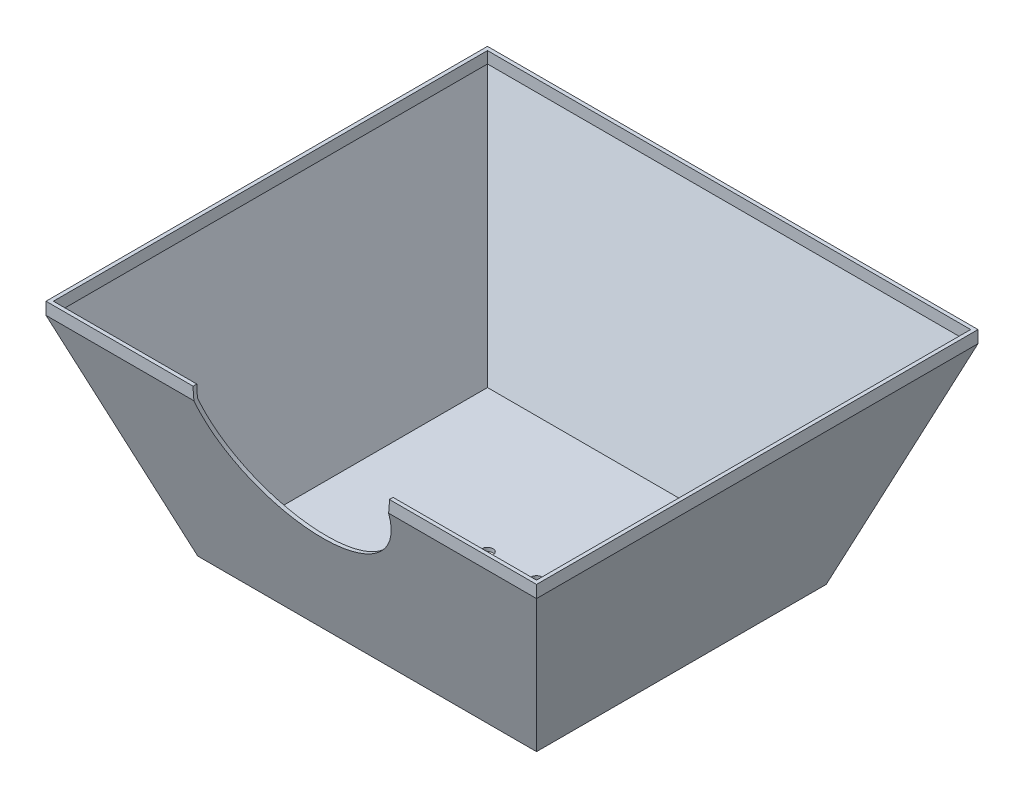
ISO-10303-21;
HEADER;
FILE_DESCRIPTION(('STEP AP214'),'2;1');
FILE_NAME('part.step','',(''),(''),'','','');
FILE_SCHEMA(('AUTOMOTIVE_DESIGN { 1 0 10303 214 1 1 1 1 }'));
ENDSEC;
DATA;
#1=APPLICATION_CONTEXT('core data for automotive mechanical design processes');
#2=APPLICATION_PROTOCOL_DEFINITION('international standard','automotive_design',2000,#1);
#3=PRODUCT_CONTEXT('',#1,'mechanical');
#4=PRODUCT('Part','Part','',(#3));
#5=PRODUCT_RELATED_PRODUCT_CATEGORY('part','',(#4));
#6=PRODUCT_DEFINITION_FORMATION('','',#4);
#7=PRODUCT_DEFINITION_CONTEXT('part definition',#1,'design');
#8=PRODUCT_DEFINITION('design','',#6,#7);
#9=PRODUCT_DEFINITION_SHAPE('','',#8);
#10=(LENGTH_UNIT() NAMED_UNIT(*) SI_UNIT(.MILLI.,.METRE.));
#11=(NAMED_UNIT(*) PLANE_ANGLE_UNIT() SI_UNIT($,.RADIAN.));
#12=(NAMED_UNIT(*) SI_UNIT($,.STERADIAN.) SOLID_ANGLE_UNIT());
#13=UNCERTAINTY_MEASURE_WITH_UNIT(LENGTH_MEASURE(1.E-05),#10,'distance_accuracy_value','');
#14=(GEOMETRIC_REPRESENTATION_CONTEXT(3) GLOBAL_UNCERTAINTY_ASSIGNED_CONTEXT((#13)) GLOBAL_UNIT_ASSIGNED_CONTEXT((#10,
#11,#12)) REPRESENTATION_CONTEXT('',''));
#15=CARTESIAN_POINT('',(0.,0.,0.));
#16=DIRECTION('',(0.,0.,1.));
#17=DIRECTION('',(1.,0.,0.));
#18=AXIS2_PLACEMENT_3D('',#15,#16,#17);
#19=CARTESIAN_POINT('',(0.,90.,0.));
#20=DIRECTION('',(0.,0.,-1.));
#21=DIRECTION('',(-1.,0.,0.));
#22=AXIS2_PLACEMENT_3D('',#19,#20,#21);
#23=PLANE('',#22);
#24=DIRECTION('',(1.,0.,0.));
#25=VECTOR('',#24,1.);
#26=CARTESIAN_POINT('',(0.,90.,0.));
#27=LINE('',#26,#25);
#28=CARTESIAN_POINT('',(140.,90.,0.));
#29=VERTEX_POINT('',#28);
#30=CARTESIAN_POINT('',(200.,90.,0.));
#31=VERTEX_POINT('',#30);
#32=EDGE_CURVE('E163',#29,#31,#27,.T.);
#33=ORIENTED_EDGE('',*,*,#32,.F.);
#34=CARTESIAN_POINT('',(100.,90.,0.));
#35=DIRECTION('',(0.,0.,1.));
#36=DIRECTION('',(1.,0.,0.));
#37=AXIS2_PLACEMENT_3D('',#34,#35,#36);
#38=CIRCLE('',#37,40.);
#39=CARTESIAN_POINT('',(139.686269665969,84.9999999999999,0.));
#40=VERTEX_POINT('',#39);
#41=EDGE_CURVE('E148',#40,#29,#38,.T.);
#42=ORIENTED_EDGE('',*,*,#41,.F.);
#43=DIRECTION('',(-1.,0.,0.));
#44=VECTOR('',#43,1.);
#45=CARTESIAN_POINT('',(200.000055,85.,0.));
#46=LINE('',#45,#44);
#47=CARTESIAN_POINT('',(200.000024148392,85.,8.61079969681874E-08));
#48=VERTEX_POINT('',#47);
#49=EDGE_CURVE('E246',#48,#40,#46,.T.);
#50=ORIENTED_EDGE('',*,*,#49,.F.);
#51=DIRECTION('',(0.,-1.,0.));
#52=VECTOR('',#51,1.);
#53=CARTESIAN_POINT('',(200.,90.,0.));
#54=LINE('',#53,#52);
#55=EDGE_CURVE('E170',#31,#48,#54,.T.);
#56=ORIENTED_EDGE('',*,*,#55,.F.);
#57=EDGE_LOOP('',(#33,#42,#50,#56));
#58=FACE_BOUND('',#57,.T.);
#59=ADVANCED_FACE('F36',(#58),#23,.F.);
#60=CARTESIAN_POINT('',(0.,90.,-1.5));
#61=DIRECTION('',(0.,0.,-1.));
#62=DIRECTION('',(-1.,0.,0.));
#63=AXIS2_PLACEMENT_3D('',#60,#61,#62);
#64=PLANE('',#63);
#65=CARTESIAN_POINT('',(100.,90.,-1.5));
#66=DIRECTION('',(0.,0.,-1.));
#67=DIRECTION('',(-1.,0.,0.));
#68=AXIS2_PLACEMENT_3D('',#65,#66,#67);
#69=CIRCLE('',#68,40.);
#70=CARTESIAN_POINT('',(140.,90.,-1.5));
#71=VERTEX_POINT('',#70);
#72=CARTESIAN_POINT('',(139.71869773169,85.2644904710628,-1.5));
#73=VERTEX_POINT('',#72);
#74=EDGE_CURVE('E52',#71,#73,#69,.T.);
#75=ORIENTED_EDGE('',*,*,#74,.F.);
#76=DIRECTION('',(1.,0.,0.));
#77=VECTOR('',#76,1.);
#78=CARTESIAN_POINT('',(0.,90.,-1.5));
#79=LINE('',#78,#77);
#80=CARTESIAN_POINT('',(198.5,90.,-1.5));
#81=VERTEX_POINT('',#80);
#82=EDGE_CURVE('E166',#71,#81,#79,.T.);
#83=ORIENTED_EDGE('',*,*,#82,.T.);
#84=DIRECTION('',(0.,-1.,0.));
#85=VECTOR('',#84,1.);
#86=CARTESIAN_POINT('',(198.5,90.,-1.5));
#87=LINE('',#86,#85);
#88=CARTESIAN_POINT('',(198.5,85.2644904710629,-1.50000000000001));
#89=VERTEX_POINT('',#88);
#90=EDGE_CURVE('E265',#81,#89,#87,.T.);
#91=ORIENTED_EDGE('',*,*,#90,.T.);
#92=DIRECTION('',(-1.,0.,0.));
#93=VECTOR('',#92,1.);
#94=CARTESIAN_POINT('',(200.000055,85.2644904710629,-1.5));
#95=LINE('',#94,#93);
#96=EDGE_CURVE('E269',#89,#73,#95,.T.);
#97=ORIENTED_EDGE('',*,*,#96,.T.);
#98=EDGE_LOOP('',(#75,#83,#91,#97));
#99=FACE_BOUND('',#98,.T.);
#100=ADVANCED_FACE('F371',(#99),#64,.T.);
#101=CARTESIAN_POINT('',(0.,0.,0.));
#102=DIRECTION('',(0.,-1.,0.));
#103=DIRECTION('',(0.,0.,-1.));
#104=AXIS2_PLACEMENT_3D('',#101,#102,#103);
#105=PLANE('',#104);
#106=CARTESIAN_POINT('',(110.,0.,-90.0000000000001));
#107=DIRECTION('',(0.,-1.,0.));
#108=DIRECTION('',(0.,0.,-1.));
#109=AXIS2_PLACEMENT_3D('',#106,#107,#108);
#110=CIRCLE('',#109,2.25000000000001);
#111=CARTESIAN_POINT('',(110.,0.,-92.2500000000001));
#112=VERTEX_POINT('',#111);
#113=EDGE_CURVE('E309',#112,#112,#110,.F.);
#114=ORIENTED_EDGE('',*,*,#113,.T.);
#115=EDGE_LOOP('',(#114));
#116=FACE_BOUND('',#115,.T.);
#117=DIRECTION('',(0.,0.,1.));
#118=VECTOR('',#117,1.);
#119=CARTESIAN_POINT('',(30.9374699126269,0.,-180.));
#120=LINE('',#119,#118);
#121=CARTESIAN_POINT('',(30.9374699126269,0.,-149.062530087373));
#122=VERTEX_POINT('',#121);
#123=CARTESIAN_POINT('',(30.9374699126269,0.,-30.937469912627));
#124=VERTEX_POINT('',#123);
#125=EDGE_CURVE('E214',#122,#124,#120,.T.);
#126=ORIENTED_EDGE('',*,*,#125,.F.);
#127=DIRECTION('',(-1.,0.,0.));
#128=VECTOR('',#127,1.);
#129=CARTESIAN_POINT('',(200.000055,0.,-149.062530087373));
#130=LINE('',#129,#128);
#131=CARTESIAN_POINT('',(169.062530087373,0.,-149.062530087373));
#132=VERTEX_POINT('',#131);
#133=EDGE_CURVE('E234',#132,#122,#130,.T.);
#134=ORIENTED_EDGE('',*,*,#133,.F.);
#135=DIRECTION('',(0.,0.,1.));
#136=VECTOR('',#135,1.);
#137=CARTESIAN_POINT('',(169.062530087373,0.,-180.));
#138=LINE('',#137,#136);
#139=CARTESIAN_POINT('',(169.062530087373,0.,-30.937469912627));
#140=VERTEX_POINT('',#139);
#141=EDGE_CURVE('E217',#132,#140,#138,.T.);
#142=ORIENTED_EDGE('',*,*,#141,.T.);
#143=DIRECTION('',(-1.,0.,0.));
#144=VECTOR('',#143,1.);
#145=CARTESIAN_POINT('',(200.000055,0.,-30.937469912627));
#146=LINE('',#145,#144);
#147=EDGE_CURVE('E233',#140,#124,#146,.T.);
#148=ORIENTED_EDGE('',*,*,#147,.T.);
#149=EDGE_LOOP('',(#126,#134,#142,#148));
#150=FACE_BOUND('',#149,.T.);
#151=CARTESIAN_POINT('',(90.,0.,-90.0000000000001));
#152=DIRECTION('',(0.,-1.,0.));
#153=DIRECTION('',(0.,0.,-1.));
#154=AXIS2_PLACEMENT_3D('',#151,#152,#153);
#155=CIRCLE('',#154,2.25);
#156=CARTESIAN_POINT('',(90.,0.,-92.2500000000001));
#157=VERTEX_POINT('',#156);
#158=EDGE_CURVE('E286',#157,#157,#155,.T.);
#159=ORIENTED_EDGE('',*,*,#158,.F.);
#160=EDGE_LOOP('',(#159));
#161=FACE_BOUND('',#160,.T.);
#162=ADVANCED_FACE('F231',(#116,#150,#161),#105,.T.);
#163=CARTESIAN_POINT('',(0.,1.5,0.));
#164=DIRECTION('',(0.,-1.,0.));
#165=DIRECTION('',(0.,0.,-1.));
#166=AXIS2_PLACEMENT_3D('',#163,#164,#165);
#167=PLANE('',#166);
#168=DIRECTION('',(0.,0.,1.));
#169=VECTOR('',#168,1.);
#170=CARTESIAN_POINT('',(31.9877812199415,1.5,-180.));
#171=LINE('',#170,#169);
#172=CARTESIAN_POINT('',(31.9877812199415,1.5,-148.012218780058));
#173=VERTEX_POINT('',#172);
#174=CARTESIAN_POINT('',(31.9877812199415,1.5,-31.9877812199415));
#175=VERTEX_POINT('',#174);
#176=EDGE_CURVE('E282',#173,#175,#171,.T.);
#177=ORIENTED_EDGE('',*,*,#176,.T.);
#178=DIRECTION('',(-1.,0.,0.));
#179=VECTOR('',#178,1.);
#180=CARTESIAN_POINT('',(200.000055,1.5,-31.9877812199416));
#181=LINE('',#180,#179);
#182=CARTESIAN_POINT('',(168.012218780059,1.5,-31.9877812199416));
#183=VERTEX_POINT('',#182);
#184=EDGE_CURVE('E283',#183,#175,#181,.T.);
#185=ORIENTED_EDGE('',*,*,#184,.F.);
#186=DIRECTION('',(0.,0.,1.));
#187=VECTOR('',#186,1.);
#188=CARTESIAN_POINT('',(168.012218780059,1.5,-180.));
#189=LINE('',#188,#187);
#190=CARTESIAN_POINT('',(168.012218780059,1.5,-148.012218780059));
#191=VERTEX_POINT('',#190);
#192=EDGE_CURVE('E291',#191,#183,#189,.T.);
#193=ORIENTED_EDGE('',*,*,#192,.F.);
#194=DIRECTION('',(-1.,0.,0.));
#195=VECTOR('',#194,1.);
#196=CARTESIAN_POINT('',(200.000055,1.5,-148.012218780059));
#197=LINE('',#196,#195);
#198=EDGE_CURVE('E272',#191,#173,#197,.T.);
#199=ORIENTED_EDGE('',*,*,#198,.T.);
#200=EDGE_LOOP('',(#177,#185,#193,#199));
#201=FACE_BOUND('',#200,.T.);
#202=CARTESIAN_POINT('',(110.,1.5,-90.0000000000001));
#203=DIRECTION('',(0.,-1.,0.));
#204=DIRECTION('',(0.,0.,-1.));
#205=AXIS2_PLACEMENT_3D('',#202,#203,#204);
#206=CIRCLE('',#205,2.25000000000001);
#207=CARTESIAN_POINT('',(110.,1.5,-92.2500000000001));
#208=VERTEX_POINT('',#207);
#209=EDGE_CURVE('E313',#208,#208,#206,.T.);
#210=ORIENTED_EDGE('',*,*,#209,.T.);
#211=EDGE_LOOP('',(#210));
#212=FACE_BOUND('',#211,.T.);
#213=CARTESIAN_POINT('',(90.,1.5,-90.0000000000001));
#214=DIRECTION('',(0.,1.,0.));
#215=DIRECTION('',(0.,0.,1.));
#216=AXIS2_PLACEMENT_3D('',#213,#214,#215);
#217=CIRCLE('',#216,2.25);
#218=CARTESIAN_POINT('',(90.,1.5,-87.7500000000001));
#219=VERTEX_POINT('',#218);
#220=EDGE_CURVE('E312',#219,#219,#217,.T.);
#221=ORIENTED_EDGE('',*,*,#220,.F.);
#222=EDGE_LOOP('',(#221));
#223=FACE_BOUND('',#222,.T.);
#224=ADVANCED_FACE('F378',(#201,#212,#223),#167,.F.);
#225=CARTESIAN_POINT('',(0.,90.,0.));
#226=DIRECTION('',(0.,-1.,0.));
#227=DIRECTION('',(0.,0.,-1.));
#228=AXIS2_PLACEMENT_3D('',#225,#226,#227);
#229=PLANE('',#228);
#230=ORIENTED_EDGE('',*,*,#82,.F.);
#231=DIRECTION('',(0.,0.,1.));
#232=VECTOR('',#231,1.);
#233=CARTESIAN_POINT('',(140.,90.,-50.));
#234=LINE('',#233,#232);
#235=EDGE_CURVE('E151',#71,#29,#234,.T.);
#236=ORIENTED_EDGE('',*,*,#235,.T.);
#237=ORIENTED_EDGE('',*,*,#32,.T.);
#238=DIRECTION('',(0.,0.,-1.));
#239=VECTOR('',#238,1.);
#240=CARTESIAN_POINT('',(200.,90.,0.));
#241=LINE('',#240,#239);
#242=CARTESIAN_POINT('',(200.,90.,-180.));
#243=VERTEX_POINT('',#242);
#244=EDGE_CURVE('E176',#31,#243,#241,.T.);
#245=ORIENTED_EDGE('',*,*,#244,.T.);
#246=DIRECTION('',(-1.,0.,0.));
#247=VECTOR('',#246,1.);
#248=CARTESIAN_POINT('',(0.,90.,-180.));
#249=LINE('',#248,#247);
#250=CARTESIAN_POINT('',(0.,90.,-180.));
#251=VERTEX_POINT('',#250);
#252=EDGE_CURVE('E183',#243,#251,#249,.T.);
#253=ORIENTED_EDGE('',*,*,#252,.T.);
#254=DIRECTION('',(0.,0.,1.));
#255=VECTOR('',#254,1.);
#256=CARTESIAN_POINT('',(0.,90.,0.));
#257=LINE('',#256,#255);
#258=CARTESIAN_POINT('',(0.,90.,0.));
#259=VERTEX_POINT('',#258);
#260=EDGE_CURVE('E173',#251,#259,#257,.T.);
#261=ORIENTED_EDGE('',*,*,#260,.T.);
#262=CARTESIAN_POINT('',(60.,90.,0.));
#263=VERTEX_POINT('',#262);
#264=EDGE_CURVE('E172',#259,#263,#27,.T.);
#265=ORIENTED_EDGE('',*,*,#264,.T.);
#266=DIRECTION('',(0.,0.,1.));
#267=VECTOR('',#266,1.);
#268=CARTESIAN_POINT('',(60.,90.,-50.));
#269=LINE('',#268,#267);
#270=CARTESIAN_POINT('',(60.,90.,-1.5));
#271=VERTEX_POINT('',#270);
#272=EDGE_CURVE('E167',#271,#263,#269,.T.);
#273=ORIENTED_EDGE('',*,*,#272,.F.);
#274=CARTESIAN_POINT('',(1.5,90.,-1.5));
#275=VERTEX_POINT('',#274);
#276=EDGE_CURVE('E257',#275,#271,#79,.T.);
#277=ORIENTED_EDGE('',*,*,#276,.F.);
#278=DIRECTION('',(0.,0.,1.));
#279=VECTOR('',#278,1.);
#280=CARTESIAN_POINT('',(1.5,90.,0.));
#281=LINE('',#280,#279);
#282=CARTESIAN_POINT('',(1.49999999999997,90.,-178.5));
#283=VERTEX_POINT('',#282);
#284=EDGE_CURVE('E260',#283,#275,#281,.T.);
#285=ORIENTED_EDGE('',*,*,#284,.F.);
#286=DIRECTION('',(-1.,0.,0.));
#287=VECTOR('',#286,1.);
#288=CARTESIAN_POINT('',(0.,90.,-178.5));
#289=LINE('',#288,#287);
#290=CARTESIAN_POINT('',(198.5,90.,-178.5));
#291=VERTEX_POINT('',#290);
#292=EDGE_CURVE('E256',#291,#283,#289,.T.);
#293=ORIENTED_EDGE('',*,*,#292,.F.);
#294=DIRECTION('',(0.,0.,-1.));
#295=VECTOR('',#294,1.);
#296=CARTESIAN_POINT('',(198.5,90.,0.));
#297=LINE('',#296,#295);
#298=EDGE_CURVE('E254',#81,#291,#297,.T.);
#299=ORIENTED_EDGE('',*,*,#298,.F.);
#300=EDGE_LOOP('',(#230,#236,#237,#245,#253,#261,#265,#273,#277,#285,#293,#299));
#301=FACE_BOUND('',#300,.T.);
#302=ADVANCED_FACE('F162',(#301),#229,.F.);
#303=CARTESIAN_POINT('',(0.,90.,-180.));
#304=DIRECTION('',(0.,0.,1.));
#305=DIRECTION('',(1.,0.,0.));
#306=AXIS2_PLACEMENT_3D('',#303,#304,#305);
#307=PLANE('',#306);
#308=DIRECTION('',(-1.,0.,0.));
#309=VECTOR('',#308,1.);
#310=CARTESIAN_POINT('',(200.000055,85.,-180.));
#311=LINE('',#310,#309);
#312=CARTESIAN_POINT('',(200.0000025,85.,-180.));
#313=VERTEX_POINT('',#312);
#314=CARTESIAN_POINT('',(0.,85.,-180.));
#315=VERTEX_POINT('',#314);
#316=EDGE_CURVE('E241',#313,#315,#311,.T.);
#317=ORIENTED_EDGE('',*,*,#316,.T.);
#318=DIRECTION('',(0.,-1.,0.));
#319=VECTOR('',#318,1.);
#320=CARTESIAN_POINT('',(0.,90.,-180.));
#321=LINE('',#320,#319);
#322=EDGE_CURVE('E185',#251,#315,#321,.T.);
#323=ORIENTED_EDGE('',*,*,#322,.F.);
#324=ORIENTED_EDGE('',*,*,#252,.F.);
#325=DIRECTION('',(0.,-1.,0.));
#326=VECTOR('',#325,1.);
#327=CARTESIAN_POINT('',(200.,90.,-180.));
#328=LINE('',#327,#326);
#329=EDGE_CURVE('E188',#243,#313,#328,.T.);
#330=ORIENTED_EDGE('',*,*,#329,.T.);
#331=EDGE_LOOP('',(#317,#323,#324,#330));
#332=FACE_BOUND('',#331,.T.);
#333=ADVANCED_FACE('F339',(#332),#307,.F.);
#334=CARTESIAN_POINT('',(200.,85.,-180.));
#335=DIRECTION('',(-0.93969262078591,0.342020143325666,0.));
#336=DIRECTION('',(-0.342020143325666,-0.93969262078591,0.));
#337=AXIS2_PLACEMENT_3D('',#334,#335,#336);
#338=PLANE('',#337);
#339=DIRECTION('',(-0.323615577118182,-0.88912649071599,0.323615577118183));
#340=VECTOR('',#339,1.);
#341=CARTESIAN_POINT('',(200.,85.,-180.));
#342=LINE('',#341,#340);
#343=EDGE_CURVE('E207',#313,#132,#342,.T.);
#344=ORIENTED_EDGE('',*,*,#343,.F.);
#345=DIRECTION('',(0.,0.,1.));
#346=VECTOR('',#345,1.);
#347=CARTESIAN_POINT('',(200.,85.,-180.));
#348=LINE('',#347,#346);
#349=EDGE_CURVE('E210',#313,#48,#348,.T.);
#350=ORIENTED_EDGE('',*,*,#349,.T.);
#351=DIRECTION('',(-0.323615577118182,-0.88912649071599,-0.323615577118183));
#352=VECTOR('',#351,1.);
#353=CARTESIAN_POINT('',(181.149132484364,33.2076671636585,-18.8508675156363));
#354=LINE('',#353,#352);
#355=EDGE_CURVE('E211',#48,#140,#354,.T.);
#356=ORIENTED_EDGE('',*,*,#355,.T.);
#357=ORIENTED_EDGE('',*,*,#141,.F.);
#358=EDGE_LOOP('',(#344,#350,#356,#357));
#359=FACE_BOUND('',#358,.T.);
#360=ADVANCED_FACE('F238',(#359),#338,.F.);
#361=CARTESIAN_POINT('',(0.,85.,-180.));
#362=DIRECTION('',(-0.939692620785909,-0.342020143325666,0.));
#363=DIRECTION('',(0.342020143325666,-0.939692620785909,0.));
#364=AXIS2_PLACEMENT_3D('',#361,#362,#363);
#365=PLANE('',#364);
#366=DIRECTION('',(0.,0.,1.));
#367=VECTOR('',#366,1.);
#368=CARTESIAN_POINT('',(0.,85.,-180.));
#369=LINE('',#368,#367);
#370=CARTESIAN_POINT('',(0.,85.,6.E-06));
#371=VERTEX_POINT('',#370);
#372=EDGE_CURVE('E178',#315,#371,#369,.T.);
#373=ORIENTED_EDGE('',*,*,#372,.F.);
#374=DIRECTION('',(0.323615577118183,-0.88912649071599,0.323615577118183));
#375=VECTOR('',#374,1.);
#376=CARTESIAN_POINT('',(0.,85.,-180.));
#377=LINE('',#376,#375);
#378=EDGE_CURVE('E46',#315,#122,#377,.T.);
#379=ORIENTED_EDGE('',*,*,#378,.T.);
#380=ORIENTED_EDGE('',*,*,#125,.T.);
#381=DIRECTION('',(0.323615577118183,-0.88912649071599,-0.323615577118183));
#382=VECTOR('',#381,1.);
#383=CARTESIAN_POINT('',(18.8508675156362,33.2076671636584,-18.8508675156362));
#384=LINE('',#383,#382);
#385=EDGE_CURVE('E197',#371,#124,#384,.T.);
#386=ORIENTED_EDGE('',*,*,#385,.F.);
#387=EDGE_LOOP('',(#373,#379,#380,#386));
#388=FACE_BOUND('',#387,.T.);
#389=ADVANCED_FACE('F334',(#388),#365,.T.);
#390=CARTESIAN_POINT('',(0.,90.,0.));
#391=DIRECTION('',(1.,0.,0.));
#392=DIRECTION('',(0.,0.,-1.));
#393=AXIS2_PLACEMENT_3D('',#390,#391,#392);
#394=PLANE('',#393);
#395=ORIENTED_EDGE('',*,*,#372,.T.);
#396=DIRECTION('',(0.,-1.,0.));
#397=VECTOR('',#396,1.);
#398=CARTESIAN_POINT('',(0.,90.,0.));
#399=LINE('',#398,#397);
#400=EDGE_CURVE('E194',#259,#371,#399,.T.);
#401=ORIENTED_EDGE('',*,*,#400,.F.);
#402=ORIENTED_EDGE('',*,*,#260,.F.);
#403=ORIENTED_EDGE('',*,*,#322,.T.);
#404=EDGE_LOOP('',(#395,#401,#402,#403));
#405=FACE_BOUND('',#404,.T.);
#406=ADVANCED_FACE('F38',(#405),#394,.F.);
#407=CARTESIAN_POINT('',(60.3137303340311,84.9999999999999,0.));
#408=VERTEX_POINT('',#407);
#409=EDGE_CURVE('E40',#408,#371,#46,.T.);
#410=ORIENTED_EDGE('',*,*,#409,.F.);
#411=EDGE_CURVE('E158',#263,#408,#38,.T.);
#412=ORIENTED_EDGE('',*,*,#411,.F.);
#413=ORIENTED_EDGE('',*,*,#264,.F.);
#414=ORIENTED_EDGE('',*,*,#400,.T.);
#415=EDGE_LOOP('',(#410,#412,#413,#414));
#416=FACE_BOUND('',#415,.T.);
#417=ADVANCED_FACE('F327',(#416),#23,.F.);
#418=CARTESIAN_POINT('',(200.,90.,0.));
#419=DIRECTION('',(-1.,0.,0.));
#420=DIRECTION('',(0.,0.,1.));
#421=AXIS2_PLACEMENT_3D('',#418,#419,#420);
#422=PLANE('',#421);
#423=ORIENTED_EDGE('',*,*,#55,.T.);
#424=ORIENTED_EDGE('',*,*,#349,.F.);
#425=ORIENTED_EDGE('',*,*,#329,.F.);
#426=ORIENTED_EDGE('',*,*,#244,.F.);
#427=EDGE_LOOP('',(#423,#424,#425,#426));
#428=FACE_BOUND('',#427,.T.);
#429=ADVANCED_FACE('F343',(#428),#422,.F.);
#430=CARTESIAN_POINT('',(200.000055,85.,0.));
#431=DIRECTION('',(0.,0.342020143325666,-0.939692620785909));
#432=DIRECTION('',(0.,0.939692620785909,0.342020143325666));
#433=AXIS2_PLACEMENT_3D('',#430,#431,#432);
#434=PLANE('',#433);
#435=ORIENTED_EDGE('',*,*,#49,.T.);
#436=CARTESIAN_POINT('',(100.,90.,1.81985117133097));
#437=DIRECTION('',(0.,0.342020143325666,-0.939692620785909));
#438=DIRECTION('',(0.,0.939692620785909,0.342020143325666));
#439=AXIS2_PLACEMENT_3D('',#436,#437,#438);
#440=ELLIPSE('',#439,42.5671108990365,40.);
#441=EDGE_CURVE('E153',#40,#408,#440,.T.);
#442=ORIENTED_EDGE('',*,*,#441,.T.);
#443=ORIENTED_EDGE('',*,*,#409,.T.);
#444=ORIENTED_EDGE('',*,*,#385,.T.);
#445=ORIENTED_EDGE('',*,*,#147,.F.);
#446=ORIENTED_EDGE('',*,*,#355,.F.);
#447=EDGE_LOOP('',(#435,#442,#443,#444,#445,#446));
#448=FACE_BOUND('',#447,.T.);
#449=ADVANCED_FACE('F325',(#448),#434,.F.);
#450=CARTESIAN_POINT('',(200.000055,85.,-180.));
#451=DIRECTION('',(0.,-0.342020143325667,-0.939692620785909));
#452=DIRECTION('',(0.,0.939692620785909,-0.342020143325667));
#453=AXIS2_PLACEMENT_3D('',#450,#451,#452);
#454=PLANE('',#453);
#455=ORIENTED_EDGE('',*,*,#343,.T.);
#456=ORIENTED_EDGE('',*,*,#133,.T.);
#457=ORIENTED_EDGE('',*,*,#378,.F.);
#458=ORIENTED_EDGE('',*,*,#316,.F.);
#459=EDGE_LOOP('',(#455,#456,#457,#458));
#460=FACE_BOUND('',#459,.T.);
#461=ADVANCED_FACE('F336',(#460),#454,.T.);
#462=CARTESIAN_POINT('',(0.,90.,-178.5));
#463=DIRECTION('',(0.,0.,1.));
#464=DIRECTION('',(1.,0.,0.));
#465=AXIS2_PLACEMENT_3D('',#462,#463,#464);
#466=PLANE('',#465);
#467=DIRECTION('',(-1.,0.,0.));
#468=VECTOR('',#467,1.);
#469=CARTESIAN_POINT('',(200.000055,85.2644904710625,-178.5));
#470=LINE('',#469,#468);
#471=CARTESIAN_POINT('',(198.5,85.2644904710626,-178.5));
#472=VERTEX_POINT('',#471);
#473=CARTESIAN_POINT('',(1.49999999999999,85.2644904710627,-178.5));
#474=VERTEX_POINT('',#473);
#475=EDGE_CURVE('E288',#472,#474,#470,.T.);
#476=ORIENTED_EDGE('',*,*,#475,.F.);
#477=DIRECTION('',(0.,-1.,0.));
#478=VECTOR('',#477,1.);
#479=CARTESIAN_POINT('',(198.5,90.,-178.5));
#480=LINE('',#479,#478);
#481=EDGE_CURVE('E60',#291,#472,#480,.T.);
#482=ORIENTED_EDGE('',*,*,#481,.F.);
#483=ORIENTED_EDGE('',*,*,#292,.T.);
#484=DIRECTION('',(0.,-1.,0.));
#485=VECTOR('',#484,1.);
#486=CARTESIAN_POINT('',(1.49999999999997,90.,-178.5));
#487=LINE('',#486,#485);
#488=EDGE_CURVE('E264',#283,#474,#487,.T.);
#489=ORIENTED_EDGE('',*,*,#488,.T.);
#490=EDGE_LOOP('',(#476,#482,#483,#489));
#491=FACE_BOUND('',#490,.T.);
#492=ADVANCED_FACE('F357',(#491),#466,.T.);
#493=CARTESIAN_POINT('',(198.590461068821,85.5130302149885,-180.));
#494=DIRECTION('',(-0.93969262078591,0.342020143325666,0.));
#495=DIRECTION('',(-0.342020143325666,-0.93969262078591,0.));
#496=AXIS2_PLACEMENT_3D('',#493,#494,#495);
#497=PLANE('',#496);
#498=DIRECTION('',(-0.323615577118182,-0.88912649071599,0.323615577118183));
#499=VECTOR('',#498,1.);
#500=CARTESIAN_POINT('',(198.73807791132,85.9186041564851,-178.73807791132));
#501=LINE('',#500,#499);
#502=EDGE_CURVE('E298',#472,#191,#501,.T.);
#503=ORIENTED_EDGE('',*,*,#502,.T.);
#504=ORIENTED_EDGE('',*,*,#192,.T.);
#505=DIRECTION('',(-0.323615577118182,-0.88912649071599,-0.323615577118183));
#506=VECTOR('',#505,1.);
#507=CARTESIAN_POINT('',(179.887210395684,34.1262713201437,-20.1127896043163));
#508=LINE('',#507,#506);
#509=EDGE_CURVE('E295',#89,#183,#508,.T.);
#510=ORIENTED_EDGE('',*,*,#509,.F.);
#511=DIRECTION('',(0.,0.,1.));
#512=VECTOR('',#511,1.);
#513=CARTESIAN_POINT('',(198.5,85.2644904710627,-180.));
#514=LINE('',#513,#512);
#515=EDGE_CURVE('E294',#472,#89,#514,.T.);
#516=ORIENTED_EDGE('',*,*,#515,.F.);
#517=EDGE_LOOP('',(#503,#504,#510,#516));
#518=FACE_BOUND('',#517,.T.);
#519=ADVANCED_FACE('F365',(#518),#497,.T.);
#520=CARTESIAN_POINT('',(1.40953893117886,85.5130302149885,-180.));
#521=DIRECTION('',(-0.939692620785909,-0.342020143325666,0.));
#522=DIRECTION('',(0.342020143325666,-0.939692620785909,0.));
#523=AXIS2_PLACEMENT_3D('',#520,#521,#522);
#524=PLANE('',#523);
#525=DIRECTION('',(0.,0.,1.));
#526=VECTOR('',#525,1.);
#527=CARTESIAN_POINT('',(1.49999999999997,85.2644904710628,-180.));
#528=LINE('',#527,#526);
#529=CARTESIAN_POINT('',(1.5,85.2644904710627,-1.5));
#530=VERTEX_POINT('',#529);
#531=EDGE_CURVE('E262',#474,#530,#528,.T.);
#532=ORIENTED_EDGE('',*,*,#531,.T.);
#533=DIRECTION('',(0.323615577118183,-0.88912649071599,-0.323615577118183));
#534=VECTOR('',#533,1.);
#535=CARTESIAN_POINT('',(20.1127896043163,34.1262713201436,-20.1127896043163));
#536=LINE('',#535,#534);
#537=EDGE_CURVE('E276',#530,#175,#536,.T.);
#538=ORIENTED_EDGE('',*,*,#537,.T.);
#539=ORIENTED_EDGE('',*,*,#176,.F.);
#540=DIRECTION('',(0.323615577118183,-0.88912649071599,0.323615577118183));
#541=VECTOR('',#540,1.);
#542=CARTESIAN_POINT('',(1.26192208868006,85.9186041564851,-178.73807791132));
#543=LINE('',#542,#541);
#544=EDGE_CURVE('E252',#474,#173,#543,.T.);
#545=ORIENTED_EDGE('',*,*,#544,.F.);
#546=EDGE_LOOP('',(#532,#538,#539,#545));
#547=FACE_BOUND('',#546,.T.);
#548=ADVANCED_FACE('F376',(#547),#524,.F.);
#549=CARTESIAN_POINT('',(1.5,90.,0.));
#550=DIRECTION('',(1.,0.,0.));
#551=DIRECTION('',(0.,0.,-1.));
#552=AXIS2_PLACEMENT_3D('',#549,#550,#551);
#553=PLANE('',#552);
#554=ORIENTED_EDGE('',*,*,#531,.F.);
#555=ORIENTED_EDGE('',*,*,#488,.F.);
#556=ORIENTED_EDGE('',*,*,#284,.T.);
#557=DIRECTION('',(0.,-1.,0.));
#558=VECTOR('',#557,1.);
#559=CARTESIAN_POINT('',(1.5,90.,-1.5));
#560=LINE('',#559,#558);
#561=EDGE_CURVE('E268',#275,#530,#560,.T.);
#562=ORIENTED_EDGE('',*,*,#561,.T.);
#563=EDGE_LOOP('',(#554,#555,#556,#562));
#564=FACE_BOUND('',#563,.T.);
#565=ADVANCED_FACE('F354',(#564),#553,.T.);
#566=CARTESIAN_POINT('',(60.2813022683102,85.2644904710627,-1.5));
#567=VERTEX_POINT('',#566);
#568=EDGE_CURVE('E319',#567,#271,#69,.T.);
#569=ORIENTED_EDGE('',*,*,#568,.F.);
#570=EDGE_CURVE('E273',#567,#530,#95,.T.);
#571=ORIENTED_EDGE('',*,*,#570,.T.);
#572=ORIENTED_EDGE('',*,*,#561,.F.);
#573=ORIENTED_EDGE('',*,*,#276,.T.);
#574=EDGE_LOOP('',(#569,#571,#572,#573));
#575=FACE_BOUND('',#574,.T.);
#576=ADVANCED_FACE('F349',(#575),#64,.T.);
#577=CARTESIAN_POINT('',(198.5,90.,0.));
#578=DIRECTION('',(-1.,0.,0.));
#579=DIRECTION('',(0.,0.,1.));
#580=AXIS2_PLACEMENT_3D('',#577,#578,#579);
#581=PLANE('',#580);
#582=ORIENTED_EDGE('',*,*,#90,.F.);
#583=ORIENTED_EDGE('',*,*,#298,.T.);
#584=ORIENTED_EDGE('',*,*,#481,.T.);
#585=ORIENTED_EDGE('',*,*,#515,.T.);
#586=EDGE_LOOP('',(#582,#583,#584,#585));
#587=FACE_BOUND('',#586,.T.);
#588=ADVANCED_FACE('F369',(#587),#581,.T.);
#589=CARTESIAN_POINT('',(200.000055,85.5130302149885,-1.40953893117894));
#590=DIRECTION('',(0.,0.342020143325666,-0.939692620785909));
#591=DIRECTION('',(0.,0.939692620785909,0.342020143325666));
#592=AXIS2_PLACEMENT_3D('',#589,#590,#591);
#593=PLANE('',#592);
#594=CARTESIAN_POINT('',(100.,90.,0.2235845126171));
#595=DIRECTION('',(0.,0.342020143325666,-0.939692620785909));
#596=DIRECTION('',(0.,0.939692620785909,0.342020143325666));
#597=AXIS2_PLACEMENT_3D('',#594,#595,#596);
#598=ELLIPSE('',#597,42.5671108990365,40.);
#599=EDGE_CURVE('E11',#73,#567,#598,.T.);
#600=ORIENTED_EDGE('',*,*,#599,.F.);
#601=ORIENTED_EDGE('',*,*,#96,.F.);
#602=ORIENTED_EDGE('',*,*,#509,.T.);
#603=ORIENTED_EDGE('',*,*,#184,.T.);
#604=ORIENTED_EDGE('',*,*,#537,.F.);
#605=ORIENTED_EDGE('',*,*,#570,.F.);
#606=EDGE_LOOP('',(#600,#601,#602,#603,#604,#605));
#607=FACE_BOUND('',#606,.T.);
#608=ADVANCED_FACE('F373',(#607),#593,.T.);
#609=CARTESIAN_POINT('',(200.000055,85.5130302149885,-178.590461068821));
#610=DIRECTION('',(0.,-0.342020143325667,-0.939692620785909));
#611=DIRECTION('',(0.,0.939692620785909,-0.342020143325667));
#612=AXIS2_PLACEMENT_3D('',#609,#610,#611);
#613=PLANE('',#612);
#614=ORIENTED_EDGE('',*,*,#502,.F.);
#615=ORIENTED_EDGE('',*,*,#475,.T.);
#616=ORIENTED_EDGE('',*,*,#544,.T.);
#617=ORIENTED_EDGE('',*,*,#198,.F.);
#618=EDGE_LOOP('',(#614,#615,#616,#617));
#619=FACE_BOUND('',#618,.T.);
#620=ADVANCED_FACE('F362',(#619),#613,.F.);
#621=CARTESIAN_POINT('',(110.,-2.50000000035378E-05,-90.0000000000001));
#622=DIRECTION('',(0.,1.,0.));
#623=DIRECTION('',(0.,0.,1.));
#624=AXIS2_PLACEMENT_3D('',#621,#622,#623);
#625=CYLINDRICAL_SURFACE('',#624,2.25000000000001);
#626=ORIENTED_EDGE('',*,*,#113,.F.);
#627=EDGE_LOOP('',(#626));
#628=FACE_BOUND('',#627,.T.);
#629=ORIENTED_EDGE('',*,*,#209,.F.);
#630=EDGE_LOOP('',(#629));
#631=FACE_BOUND('',#630,.T.);
#632=ADVANCED_FACE('F388',(#628,#631),#625,.F.);
#633=CARTESIAN_POINT('',(90.,-2.50000000035378E-05,-90.0000000000001));
#634=DIRECTION('',(0.,1.,0.));
#635=DIRECTION('',(0.,0.,1.));
#636=AXIS2_PLACEMENT_3D('',#633,#634,#635);
#637=CYLINDRICAL_SURFACE('',#636,2.25);
#638=ORIENTED_EDGE('',*,*,#158,.T.);
#639=EDGE_LOOP('',(#638));
#640=FACE_BOUND('',#639,.T.);
#641=ORIENTED_EDGE('',*,*,#220,.T.);
#642=EDGE_LOOP('',(#641));
#643=FACE_BOUND('',#642,.T.);
#644=ADVANCED_FACE('F386',(#640,#643),#637,.F.);
#645=CARTESIAN_POINT('',(100.,90.,-50.));
#646=DIRECTION('',(0.,0.,1.));
#647=DIRECTION('',(1.,0.,0.));
#648=AXIS2_PLACEMENT_3D('',#645,#646,#647);
#649=CYLINDRICAL_SURFACE('',#648,40.);
#650=ORIENTED_EDGE('',*,*,#41,.T.);
#651=ORIENTED_EDGE('',*,*,#235,.F.);
#652=ORIENTED_EDGE('',*,*,#74,.T.);
#653=ORIENTED_EDGE('',*,*,#599,.T.);
#654=ORIENTED_EDGE('',*,*,#568,.T.);
#655=ORIENTED_EDGE('',*,*,#272,.T.);
#656=ORIENTED_EDGE('',*,*,#411,.T.);
#657=ORIENTED_EDGE('',*,*,#441,.F.);
#658=EDGE_LOOP('',(#650,#651,#652,#653,#654,#655,#656,#657));
#659=FACE_BOUND('',#658,.T.);
#660=ADVANCED_FACE('F150',(#659),#649,.F.);
#661=CLOSED_SHELL('',(#59,#100,#162,#224,#302,#333,#360,#389,#406,#417,#429,#449,#461,#492,#519,
#548,#565,#576,#588,#608,#620,#632,#644,#660));
#662=MANIFOLD_SOLID_BREP('B2',#661);
#663=ADVANCED_BREP_SHAPE_REPRESENTATION('',(#18,#662),#14);
#664=SHAPE_DEFINITION_REPRESENTATION(#9,#663);
ENDSEC;
END-ISO-10303-21;
